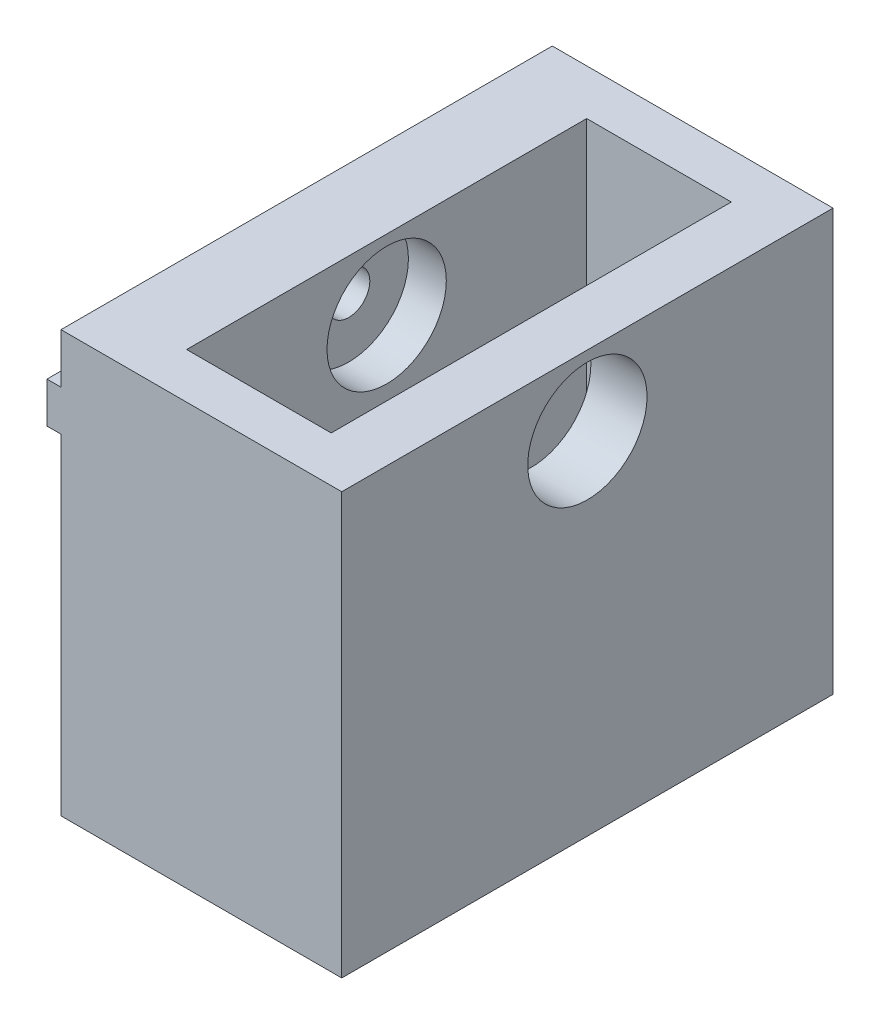
ISO-10303-21;
HEADER;
FILE_DESCRIPTION(('STEP AP214'),'2;1');
FILE_NAME('part.step','',(''),(''),'','','');
FILE_SCHEMA(('AUTOMOTIVE_DESIGN { 1 0 10303 214 1 1 1 1 }'));
ENDSEC;
DATA;
#1=APPLICATION_CONTEXT('core data for automotive mechanical design processes');
#2=APPLICATION_PROTOCOL_DEFINITION('international standard','automotive_design',2000,#1);
#3=PRODUCT_CONTEXT('',#1,'mechanical');
#4=PRODUCT('Part','Part','',(#3));
#5=PRODUCT_RELATED_PRODUCT_CATEGORY('part','',(#4));
#6=PRODUCT_DEFINITION_FORMATION('','',#4);
#7=PRODUCT_DEFINITION_CONTEXT('part definition',#1,'design');
#8=PRODUCT_DEFINITION('design','',#6,#7);
#9=PRODUCT_DEFINITION_SHAPE('','',#8);
#10=(LENGTH_UNIT() NAMED_UNIT(*) SI_UNIT(.MILLI.,.METRE.));
#11=(NAMED_UNIT(*) PLANE_ANGLE_UNIT() SI_UNIT($,.RADIAN.));
#12=(NAMED_UNIT(*) SI_UNIT($,.STERADIAN.) SOLID_ANGLE_UNIT());
#13=UNCERTAINTY_MEASURE_WITH_UNIT(LENGTH_MEASURE(1.E-05),#10,'distance_accuracy_value','');
#14=(GEOMETRIC_REPRESENTATION_CONTEXT(3) GLOBAL_UNCERTAINTY_ASSIGNED_CONTEXT((#13)) GLOBAL_UNIT_ASSIGNED_CONTEXT((#10,
#11,#12)) REPRESENTATION_CONTEXT('',''));
#15=CARTESIAN_POINT('',(0.,0.,0.));
#16=DIRECTION('',(0.,0.,1.));
#17=DIRECTION('',(1.,0.,0.));
#18=AXIS2_PLACEMENT_3D('',#15,#16,#17);
#19=CARTESIAN_POINT('',(20.,25.,0.));
#20=DIRECTION('',(-1.,0.,0.));
#21=DIRECTION('',(0.,-1.,0.));
#22=AXIS2_PLACEMENT_3D('',#19,#20,#21);
#23=CYLINDRICAL_SURFACE('',#22,1.5);
#24=CARTESIAN_POINT('',(0.,25.,0.));
#25=DIRECTION('',(1.,0.,0.));
#26=DIRECTION('',(0.,0.,-1.));
#27=AXIS2_PLACEMENT_3D('',#24,#25,#26);
#28=CIRCLE('',#27,1.5);
#29=CARTESIAN_POINT('',(0.,23.55,0.384057287393436));
#30=VERTEX_POINT('',#29);
#31=CARTESIAN_POINT('',(0.,23.55,-0.384057287393436));
#32=VERTEX_POINT('',#31);
#33=EDGE_CURVE('E151',#30,#32,#28,.T.);
#34=ORIENTED_EDGE('',*,*,#33,.F.);
#35=DIRECTION('',(-1.,0.,0.));
#36=VECTOR('',#35,1.);
#37=CARTESIAN_POINT('',(20.,23.5500000000001,0.384057287393672));
#38=LINE('',#37,#36);
#39=CARTESIAN_POINT('',(-0.999999999999998,23.55,0.384057287393423));
#40=VERTEX_POINT('',#39);
#41=EDGE_CURVE('E146',#40,#30,#38,.F.);
#42=ORIENTED_EDGE('',*,*,#41,.F.);
#43=CARTESIAN_POINT('',(-0.999999999999999,25.,0.));
#44=DIRECTION('',(-1.,0.,0.));
#45=DIRECTION('',(0.,-1.,0.));
#46=AXIS2_PLACEMENT_3D('',#43,#44,#45);
#47=CIRCLE('',#46,1.5);
#48=CARTESIAN_POINT('',(-0.999999999999999,26.45,0.384057287393449));
#49=VERTEX_POINT('',#48);
#50=EDGE_CURVE('E149',#40,#49,#47,.T.);
#51=ORIENTED_EDGE('',*,*,#50,.T.);
#52=DIRECTION('',(-1.,0.,0.));
#53=VECTOR('',#52,1.);
#54=CARTESIAN_POINT('',(20.,26.4500000000001,0.3840572873932));
#55=LINE('',#54,#53);
#56=CARTESIAN_POINT('',(0.,26.45,0.384057287393436));
#57=VERTEX_POINT('',#56);
#58=EDGE_CURVE('E50',#57,#49,#55,.T.);
#59=ORIENTED_EDGE('',*,*,#58,.F.);
#60=CARTESIAN_POINT('',(0.,25.,0.));
#61=DIRECTION('',(1.,0.,0.));
#62=DIRECTION('',(0.,0.,-1.));
#63=AXIS2_PLACEMENT_3D('',#60,#61,#62);
#64=CIRCLE('',#63,1.5);
#65=CARTESIAN_POINT('',(0.,26.45,-0.384057287393436));
#66=VERTEX_POINT('',#65);
#67=EDGE_CURVE('E164',#66,#57,#64,.T.);
#68=ORIENTED_EDGE('',*,*,#67,.F.);
#69=DIRECTION('',(-1.,0.,0.));
#70=VECTOR('',#69,1.);
#71=CARTESIAN_POINT('',(20.,26.4500000000001,-0.3840572873932));
#72=LINE('',#71,#70);
#73=CARTESIAN_POINT('',(-0.999999999999999,26.45,-0.384057287393449));
#74=VERTEX_POINT('',#73);
#75=EDGE_CURVE('E192',#74,#66,#72,.F.);
#76=ORIENTED_EDGE('',*,*,#75,.F.);
#77=CARTESIAN_POINT('',(-0.999999999999998,23.55,-0.384057287393423));
#78=VERTEX_POINT('',#77);
#79=EDGE_CURVE('E165',#74,#78,#47,.T.);
#80=ORIENTED_EDGE('',*,*,#79,.T.);
#81=DIRECTION('',(-1.,0.,0.));
#82=VECTOR('',#81,1.);
#83=CARTESIAN_POINT('',(20.,23.5500000000001,-0.384057287393672));
#84=LINE('',#83,#82);
#85=EDGE_CURVE('E156',#32,#78,#84,.T.);
#86=ORIENTED_EDGE('',*,*,#85,.F.);
#87=EDGE_LOOP('',(#34,#42,#51,#59,#68,#76,#80,#86));
#88=FACE_BOUND('',#87,.T.);
#89=CARTESIAN_POINT('',(3.,25.,0.));
#90=DIRECTION('',(1.,0.,0.));
#91=DIRECTION('',(0.,0.,-1.));
#92=AXIS2_PLACEMENT_3D('',#89,#90,#91);
#93=CIRCLE('',#92,1.5);
#94=CARTESIAN_POINT('',(3.,25.,-1.5));
#95=VERTEX_POINT('',#94);
#96=EDGE_CURVE('E174',#95,#95,#93,.F.);
#97=ORIENTED_EDGE('',*,*,#96,.F.);
#98=EDGE_LOOP('',(#97));
#99=FACE_BOUND('',#98,.T.);
#100=ADVANCED_FACE('F33',(#88,#99),#23,.F.);
#101=CARTESIAN_POINT('',(0.,26.45,17.5));
#102=DIRECTION('',(0.,-1.,0.));
#103=DIRECTION('',(1.,0.,0.));
#104=AXIS2_PLACEMENT_3D('',#101,#102,#103);
#105=PLANE('',#104);
#106=DIRECTION('',(0.,0.,-1.));
#107=VECTOR('',#106,1.);
#108=CARTESIAN_POINT('',(0.,26.45,17.5));
#109=LINE('',#108,#107);
#110=CARTESIAN_POINT('',(0.,26.45,17.5));
#111=VERTEX_POINT('',#110);
#112=EDGE_CURVE('E266',#111,#57,#109,.T.);
#113=ORIENTED_EDGE('',*,*,#112,.T.);
#114=ORIENTED_EDGE('',*,*,#58,.T.);
#115=DIRECTION('',(0.,0.,-1.));
#116=VECTOR('',#115,1.);
#117=CARTESIAN_POINT('',(-1.,26.45,17.5));
#118=LINE('',#117,#116);
#119=CARTESIAN_POINT('',(-1.,26.45,17.5));
#120=VERTEX_POINT('',#119);
#121=EDGE_CURVE('E11',#120,#49,#118,.T.);
#122=ORIENTED_EDGE('',*,*,#121,.F.);
#123=DIRECTION('',(-1.,0.,0.));
#124=VECTOR('',#123,1.);
#125=CARTESIAN_POINT('',(0.,26.45,17.5));
#126=LINE('',#125,#124);
#127=EDGE_CURVE('E230',#111,#120,#126,.T.);
#128=ORIENTED_EDGE('',*,*,#127,.F.);
#129=EDGE_LOOP('',(#113,#114,#122,#128));
#130=FACE_BOUND('',#129,.T.);
#131=ADVANCED_FACE('F295',(#130),#105,.F.);
#132=CARTESIAN_POINT('',(-1.,26.45,17.5));
#133=DIRECTION('',(1.,0.,0.));
#134=DIRECTION('',(0.,1.,0.));
#135=AXIS2_PLACEMENT_3D('',#132,#133,#134);
#136=PLANE('',#135);
#137=ORIENTED_EDGE('',*,*,#121,.T.);
#138=ORIENTED_EDGE('',*,*,#50,.F.);
#139=DIRECTION('',(0.,0.,-1.));
#140=VECTOR('',#139,1.);
#141=CARTESIAN_POINT('',(-0.999999999999999,23.55,17.5));
#142=LINE('',#141,#140);
#143=CARTESIAN_POINT('',(-0.999999999999999,23.55,17.5));
#144=VERTEX_POINT('',#143);
#145=EDGE_CURVE('E161',#144,#40,#142,.T.);
#146=ORIENTED_EDGE('',*,*,#145,.F.);
#147=DIRECTION('',(0.,-1.,0.));
#148=VECTOR('',#147,1.);
#149=CARTESIAN_POINT('',(-1.,26.45,17.5));
#150=LINE('',#149,#148);
#151=EDGE_CURVE('E233',#120,#144,#150,.T.);
#152=ORIENTED_EDGE('',*,*,#151,.F.);
#153=EDGE_LOOP('',(#137,#138,#146,#152));
#154=FACE_BOUND('',#153,.T.);
#155=ADVANCED_FACE('F160',(#154),#136,.F.);
#156=CARTESIAN_POINT('',(-0.999999999999999,23.55,17.5));
#157=DIRECTION('',(0.,1.,0.));
#158=DIRECTION('',(-1.,0.,0.));
#159=AXIS2_PLACEMENT_3D('',#156,#157,#158);
#160=PLANE('',#159);
#161=DIRECTION('',(0.,0.,-1.));
#162=VECTOR('',#161,1.);
#163=CARTESIAN_POINT('',(0.,23.55,17.5));
#164=LINE('',#163,#162);
#165=CARTESIAN_POINT('',(0.,23.55,-17.5));
#166=VERTEX_POINT('',#165);
#167=EDGE_CURVE('E279',#32,#166,#164,.T.);
#168=ORIENTED_EDGE('',*,*,#167,.F.);
#169=ORIENTED_EDGE('',*,*,#85,.T.);
#170=CARTESIAN_POINT('',(-0.999999999999999,23.55,-17.5));
#171=VERTEX_POINT('',#170);
#172=EDGE_CURVE('E169',#78,#171,#142,.T.);
#173=ORIENTED_EDGE('',*,*,#172,.T.);
#174=DIRECTION('',(1.,0.,0.));
#175=VECTOR('',#174,1.);
#176=CARTESIAN_POINT('',(-0.999999999999999,23.55,-17.5));
#177=LINE('',#176,#175);
#178=EDGE_CURVE('E253',#171,#166,#177,.T.);
#179=ORIENTED_EDGE('',*,*,#178,.T.);
#180=EDGE_LOOP('',(#168,#169,#173,#179));
#181=FACE_BOUND('',#180,.T.);
#182=ADVANCED_FACE('F313',(#181),#160,.F.);
#183=CARTESIAN_POINT('',(-1.,26.45,-17.5));
#184=VERTEX_POINT('',#183);
#185=EDGE_CURVE('E42',#74,#184,#118,.T.);
#186=ORIENTED_EDGE('',*,*,#185,.F.);
#187=ORIENTED_EDGE('',*,*,#75,.T.);
#188=CARTESIAN_POINT('',(0.,26.45,-17.5));
#189=VERTEX_POINT('',#188);
#190=EDGE_CURVE('E247',#66,#189,#109,.T.);
#191=ORIENTED_EDGE('',*,*,#190,.T.);
#192=DIRECTION('',(-1.,0.,0.));
#193=VECTOR('',#192,1.);
#194=CARTESIAN_POINT('',(0.,26.45,-17.5));
#195=LINE('',#194,#193);
#196=EDGE_CURVE('E223',#189,#184,#195,.T.);
#197=ORIENTED_EDGE('',*,*,#196,.T.);
#198=EDGE_LOOP('',(#186,#187,#191,#197));
#199=FACE_BOUND('',#198,.T.);
#200=ADVANCED_FACE('F35',(#199),#105,.F.);
#201=ORIENTED_EDGE('',*,*,#172,.F.);
#202=ORIENTED_EDGE('',*,*,#79,.F.);
#203=ORIENTED_EDGE('',*,*,#185,.T.);
#204=DIRECTION('',(0.,-1.,0.));
#205=VECTOR('',#204,1.);
#206=CARTESIAN_POINT('',(-1.,26.45,-17.5));
#207=LINE('',#206,#205);
#208=EDGE_CURVE('E250',#184,#171,#207,.T.);
#209=ORIENTED_EDGE('',*,*,#208,.T.);
#210=EDGE_LOOP('',(#201,#202,#203,#209));
#211=FACE_BOUND('',#210,.T.);
#212=ADVANCED_FACE('F306',(#211),#136,.F.);
#213=ORIENTED_EDGE('',*,*,#145,.T.);
#214=ORIENTED_EDGE('',*,*,#41,.T.);
#215=CARTESIAN_POINT('',(0.,23.55,17.5));
#216=VERTEX_POINT('',#215);
#217=EDGE_CURVE('E171',#216,#30,#164,.T.);
#218=ORIENTED_EDGE('',*,*,#217,.F.);
#219=DIRECTION('',(1.,0.,0.));
#220=VECTOR('',#219,1.);
#221=CARTESIAN_POINT('',(-0.999999999999999,23.55,17.5));
#222=LINE('',#221,#220);
#223=EDGE_CURVE('E168',#144,#216,#222,.T.);
#224=ORIENTED_EDGE('',*,*,#223,.F.);
#225=EDGE_LOOP('',(#213,#214,#218,#224));
#226=FACE_BOUND('',#225,.T.);
#227=ADVANCED_FACE('F167',(#226),#160,.F.);
#228=CARTESIAN_POINT('',(0.,23.55,17.5));
#229=DIRECTION('',(1.,0.,0.));
#230=DIRECTION('',(0.,0.,-1.));
#231=AXIS2_PLACEMENT_3D('',#228,#229,#230);
#232=PLANE('',#231);
#233=ORIENTED_EDGE('',*,*,#217,.T.);
#234=ORIENTED_EDGE('',*,*,#33,.T.);
#235=ORIENTED_EDGE('',*,*,#167,.T.);
#236=DIRECTION('',(0.,-1.,0.));
#237=VECTOR('',#236,1.);
#238=CARTESIAN_POINT('',(0.,23.55,-17.5));
#239=LINE('',#238,#237);
#240=CARTESIAN_POINT('',(0.,0.,-17.5));
#241=VERTEX_POINT('',#240);
#242=EDGE_CURVE('E256',#166,#241,#239,.T.);
#243=ORIENTED_EDGE('',*,*,#242,.T.);
#244=DIRECTION('',(0.,0.,-1.));
#245=VECTOR('',#244,1.);
#246=CARTESIAN_POINT('',(0.,0.,17.5));
#247=LINE('',#246,#245);
#248=CARTESIAN_POINT('',(0.,0.,17.5));
#249=VERTEX_POINT('',#248);
#250=EDGE_CURVE('E277',#249,#241,#247,.T.);
#251=ORIENTED_EDGE('',*,*,#250,.F.);
#252=DIRECTION('',(0.,-1.,0.));
#253=VECTOR('',#252,1.);
#254=CARTESIAN_POINT('',(0.,23.55,17.5));
#255=LINE('',#254,#253);
#256=EDGE_CURVE('E237',#216,#249,#255,.T.);
#257=ORIENTED_EDGE('',*,*,#256,.F.);
#258=EDGE_LOOP('',(#233,#234,#235,#243,#251,#257));
#259=FACE_BOUND('',#258,.T.);
#260=ADVANCED_FACE('F287',(#259),#232,.F.);
#261=CARTESIAN_POINT('',(0.,0.,17.5));
#262=DIRECTION('',(0.,1.,0.));
#263=DIRECTION('',(0.,0.,1.));
#264=AXIS2_PLACEMENT_3D('',#261,#262,#263);
#265=PLANE('',#264);
#266=DIRECTION('',(-1.,0.,0.));
#267=VECTOR('',#266,1.);
#268=CARTESIAN_POINT('',(5.69999999999999,0.,-14.25));
#269=LINE('',#268,#267);
#270=CARTESIAN_POINT('',(16.,0.,-14.25));
#271=VERTEX_POINT('',#270);
#272=CARTESIAN_POINT('',(5.69999999999999,0.,-14.25));
#273=VERTEX_POINT('',#272);
#274=EDGE_CURVE('E208',#271,#273,#269,.T.);
#275=ORIENTED_EDGE('',*,*,#274,.T.);
#276=DIRECTION('',(0.,0.,1.));
#277=VECTOR('',#276,1.);
#278=CARTESIAN_POINT('',(5.69999999999999,0.,-14.25));
#279=LINE('',#278,#277);
#280=CARTESIAN_POINT('',(5.69999999999999,0.,14.25));
#281=VERTEX_POINT('',#280);
#282=EDGE_CURVE('E200',#273,#281,#279,.T.);
#283=ORIENTED_EDGE('',*,*,#282,.T.);
#284=DIRECTION('',(1.,0.,0.));
#285=VECTOR('',#284,1.);
#286=CARTESIAN_POINT('',(5.69999999999999,0.,14.25));
#287=LINE('',#286,#285);
#288=CARTESIAN_POINT('',(16.,0.,14.25));
#289=VERTEX_POINT('',#288);
#290=EDGE_CURVE('E203',#281,#289,#287,.T.);
#291=ORIENTED_EDGE('',*,*,#290,.T.);
#292=DIRECTION('',(0.,0.,-1.));
#293=VECTOR('',#292,1.);
#294=CARTESIAN_POINT('',(16.,0.,-14.25));
#295=LINE('',#294,#293);
#296=EDGE_CURVE('E58',#289,#271,#295,.T.);
#297=ORIENTED_EDGE('',*,*,#296,.T.);
#298=EDGE_LOOP('',(#275,#283,#291,#297));
#299=FACE_BOUND('',#298,.T.);
#300=DIRECTION('',(1.,0.,0.));
#301=VECTOR('',#300,1.);
#302=CARTESIAN_POINT('',(0.,0.,-17.5));
#303=LINE('',#302,#301);
#304=CARTESIAN_POINT('',(20.,0.,-17.5));
#305=VERTEX_POINT('',#304);
#306=EDGE_CURVE('E258',#241,#305,#303,.T.);
#307=ORIENTED_EDGE('',*,*,#306,.T.);
#308=DIRECTION('',(0.,0.,-1.));
#309=VECTOR('',#308,1.);
#310=CARTESIAN_POINT('',(20.,0.,17.5));
#311=LINE('',#310,#309);
#312=CARTESIAN_POINT('',(20.,0.,17.5));
#313=VERTEX_POINT('',#312);
#314=EDGE_CURVE('E275',#313,#305,#311,.T.);
#315=ORIENTED_EDGE('',*,*,#314,.F.);
#316=DIRECTION('',(1.,0.,0.));
#317=VECTOR('',#316,1.);
#318=CARTESIAN_POINT('',(0.,0.,17.5));
#319=LINE('',#318,#317);
#320=EDGE_CURVE('E239',#249,#313,#319,.T.);
#321=ORIENTED_EDGE('',*,*,#320,.F.);
#322=ORIENTED_EDGE('',*,*,#250,.T.);
#323=EDGE_LOOP('',(#307,#315,#321,#322));
#324=FACE_BOUND('',#323,.T.);
#325=ADVANCED_FACE('F361',(#299,#324),#265,.F.);
#326=CARTESIAN_POINT('',(20.,0.,17.5));
#327=DIRECTION('',(-1.,0.,0.));
#328=DIRECTION('',(0.,-1.,0.));
#329=AXIS2_PLACEMENT_3D('',#326,#327,#328);
#330=PLANE('',#329);
#331=CARTESIAN_POINT('',(20.,25.,0.));
#332=DIRECTION('',(1.,0.,0.));
#333=DIRECTION('',(0.,0.,-1.));
#334=AXIS2_PLACEMENT_3D('',#331,#332,#333);
#335=CIRCLE('',#334,4.25);
#336=CARTESIAN_POINT('',(20.,25.,-4.25));
#337=VERTEX_POINT('',#336);
#338=EDGE_CURVE('E182',#337,#337,#335,.T.);
#339=ORIENTED_EDGE('',*,*,#338,.F.);
#340=EDGE_LOOP('',(#339));
#341=FACE_BOUND('',#340,.T.);
#342=DIRECTION('',(0.,1.,0.));
#343=VECTOR('',#342,1.);
#344=CARTESIAN_POINT('',(20.,0.,-17.5));
#345=LINE('',#344,#343);
#346=CARTESIAN_POINT('',(20.,30.,-17.5));
#347=VERTEX_POINT('',#346);
#348=EDGE_CURVE('E260',#305,#347,#345,.T.);
#349=ORIENTED_EDGE('',*,*,#348,.T.);
#350=DIRECTION('',(0.,0.,-1.));
#351=VECTOR('',#350,1.);
#352=CARTESIAN_POINT('',(20.,30.,17.5));
#353=LINE('',#352,#351);
#354=CARTESIAN_POINT('',(20.,30.,17.5));
#355=VERTEX_POINT('',#354);
#356=EDGE_CURVE('E272',#355,#347,#353,.T.);
#357=ORIENTED_EDGE('',*,*,#356,.F.);
#358=DIRECTION('',(0.,1.,0.));
#359=VECTOR('',#358,1.);
#360=CARTESIAN_POINT('',(20.,0.,17.5));
#361=LINE('',#360,#359);
#362=EDGE_CURVE('E241',#313,#355,#361,.T.);
#363=ORIENTED_EDGE('',*,*,#362,.F.);
#364=ORIENTED_EDGE('',*,*,#314,.T.);
#365=EDGE_LOOP('',(#349,#357,#363,#364));
#366=FACE_BOUND('',#365,.T.);
#367=ADVANCED_FACE('F357',(#341,#366),#330,.F.);
#368=CARTESIAN_POINT('',(20.,30.,17.5));
#369=DIRECTION('',(0.,-1.,0.));
#370=DIRECTION('',(0.,0.,-1.));
#371=AXIS2_PLACEMENT_3D('',#368,#369,#370);
#372=PLANE('',#371);
#373=DIRECTION('',(1.,0.,0.));
#374=VECTOR('',#373,1.);
#375=CARTESIAN_POINT('',(5.69999999999999,30.,14.25));
#376=LINE('',#375,#374);
#377=CARTESIAN_POINT('',(5.69999999999999,30.,14.25));
#378=VERTEX_POINT('',#377);
#379=CARTESIAN_POINT('',(16.,30.,14.25));
#380=VERTEX_POINT('',#379);
#381=EDGE_CURVE('E213',#378,#380,#376,.T.);
#382=ORIENTED_EDGE('',*,*,#381,.F.);
#383=DIRECTION('',(0.,0.,1.));
#384=VECTOR('',#383,1.);
#385=CARTESIAN_POINT('',(5.69999999999999,30.,-14.25));
#386=LINE('',#385,#384);
#387=CARTESIAN_POINT('',(5.69999999999999,30.,-14.25));
#388=VERTEX_POINT('',#387);
#389=EDGE_CURVE('E199',#388,#378,#386,.T.);
#390=ORIENTED_EDGE('',*,*,#389,.F.);
#391=DIRECTION('',(-1.,0.,0.));
#392=VECTOR('',#391,1.);
#393=CARTESIAN_POINT('',(5.69999999999999,30.,-14.25));
#394=LINE('',#393,#392);
#395=CARTESIAN_POINT('',(16.,30.,-14.25));
#396=VERTEX_POINT('',#395);
#397=EDGE_CURVE('E204',#396,#388,#394,.T.);
#398=ORIENTED_EDGE('',*,*,#397,.F.);
#399=DIRECTION('',(0.,0.,-1.));
#400=VECTOR('',#399,1.);
#401=CARTESIAN_POINT('',(16.,30.,-14.25));
#402=LINE('',#401,#400);
#403=EDGE_CURVE('E216',#380,#396,#402,.T.);
#404=ORIENTED_EDGE('',*,*,#403,.F.);
#405=EDGE_LOOP('',(#382,#390,#398,#404));
#406=FACE_BOUND('',#405,.T.);
#407=DIRECTION('',(-1.,0.,0.));
#408=VECTOR('',#407,1.);
#409=CARTESIAN_POINT('',(20.,30.,-17.5));
#410=LINE('',#409,#408);
#411=CARTESIAN_POINT('',(0.,30.,-17.5));
#412=VERTEX_POINT('',#411);
#413=EDGE_CURVE('E262',#347,#412,#410,.T.);
#414=ORIENTED_EDGE('',*,*,#413,.T.);
#415=DIRECTION('',(0.,0.,-1.));
#416=VECTOR('',#415,1.);
#417=CARTESIAN_POINT('',(0.,30.,17.5));
#418=LINE('',#417,#416);
#419=CARTESIAN_POINT('',(0.,30.,17.5));
#420=VERTEX_POINT('',#419);
#421=EDGE_CURVE('E269',#420,#412,#418,.T.);
#422=ORIENTED_EDGE('',*,*,#421,.F.);
#423=DIRECTION('',(-1.,0.,0.));
#424=VECTOR('',#423,1.);
#425=CARTESIAN_POINT('',(20.,30.,17.5));
#426=LINE('',#425,#424);
#427=EDGE_CURVE('E243',#355,#420,#426,.T.);
#428=ORIENTED_EDGE('',*,*,#427,.F.);
#429=ORIENTED_EDGE('',*,*,#356,.T.);
#430=EDGE_LOOP('',(#414,#422,#428,#429));
#431=FACE_BOUND('',#430,.T.);
#432=ADVANCED_FACE('F354',(#406,#431),#372,.F.);
#433=CARTESIAN_POINT('',(0.,30.,17.5));
#434=DIRECTION('',(1.,0.,0.));
#435=DIRECTION('',(0.,0.,-1.));
#436=AXIS2_PLACEMENT_3D('',#433,#434,#435);
#437=PLANE('',#436);
#438=ORIENTED_EDGE('',*,*,#190,.F.);
#439=ORIENTED_EDGE('',*,*,#67,.T.);
#440=ORIENTED_EDGE('',*,*,#112,.F.);
#441=DIRECTION('',(0.,-1.,0.));
#442=VECTOR('',#441,1.);
#443=CARTESIAN_POINT('',(0.,30.,17.5));
#444=LINE('',#443,#442);
#445=EDGE_CURVE('E245',#420,#111,#444,.T.);
#446=ORIENTED_EDGE('',*,*,#445,.F.);
#447=ORIENTED_EDGE('',*,*,#421,.T.);
#448=DIRECTION('',(0.,-1.,0.));
#449=VECTOR('',#448,1.);
#450=CARTESIAN_POINT('',(0.,30.,-17.5));
#451=LINE('',#450,#449);
#452=EDGE_CURVE('E234',#412,#189,#451,.T.);
#453=ORIENTED_EDGE('',*,*,#452,.T.);
#454=EDGE_LOOP('',(#438,#439,#440,#446,#447,#453));
#455=FACE_BOUND('',#454,.T.);
#456=ADVANCED_FACE('F298',(#455),#437,.F.);
#457=CARTESIAN_POINT('',(0.,0.,17.5));
#458=DIRECTION('',(0.,0.,1.));
#459=DIRECTION('',(1.,0.,0.));
#460=AXIS2_PLACEMENT_3D('',#457,#458,#459);
#461=PLANE('',#460);
#462=ORIENTED_EDGE('',*,*,#127,.T.);
#463=ORIENTED_EDGE('',*,*,#151,.T.);
#464=ORIENTED_EDGE('',*,*,#223,.T.);
#465=ORIENTED_EDGE('',*,*,#256,.T.);
#466=ORIENTED_EDGE('',*,*,#320,.T.);
#467=ORIENTED_EDGE('',*,*,#362,.T.);
#468=ORIENTED_EDGE('',*,*,#427,.T.);
#469=ORIENTED_EDGE('',*,*,#445,.T.);
#470=EDGE_LOOP('',(#462,#463,#464,#465,#466,#467,#468,#469));
#471=FACE_BOUND('',#470,.T.);
#472=ADVANCED_FACE('F289',(#471),#461,.T.);
#473=CARTESIAN_POINT('',(0.,0.,-17.5));
#474=DIRECTION('',(0.,0.,1.));
#475=DIRECTION('',(1.,0.,0.));
#476=AXIS2_PLACEMENT_3D('',#473,#474,#475);
#477=PLANE('',#476);
#478=ORIENTED_EDGE('',*,*,#196,.F.);
#479=ORIENTED_EDGE('',*,*,#452,.F.);
#480=ORIENTED_EDGE('',*,*,#413,.F.);
#481=ORIENTED_EDGE('',*,*,#348,.F.);
#482=ORIENTED_EDGE('',*,*,#306,.F.);
#483=ORIENTED_EDGE('',*,*,#242,.F.);
#484=ORIENTED_EDGE('',*,*,#178,.F.);
#485=ORIENTED_EDGE('',*,*,#208,.F.);
#486=EDGE_LOOP('',(#478,#479,#480,#481,#482,#483,#484,#485));
#487=FACE_BOUND('',#486,.T.);
#488=ADVANCED_FACE('F309',(#487),#477,.F.);
#489=CARTESIAN_POINT('',(5.69999999999999,0.,-14.25));
#490=DIRECTION('',(-1.,0.,0.));
#491=DIRECTION('',(0.,0.,1.));
#492=AXIS2_PLACEMENT_3D('',#489,#490,#491);
#493=PLANE('',#492);
#494=CARTESIAN_POINT('',(5.69999999999999,25.,0.));
#495=DIRECTION('',(-1.,0.,0.));
#496=DIRECTION('',(0.,0.,1.));
#497=AXIS2_PLACEMENT_3D('',#494,#495,#496);
#498=CIRCLE('',#497,4.25);
#499=CARTESIAN_POINT('',(5.69999999999999,25.,4.25));
#500=VERTEX_POINT('',#499);
#501=EDGE_CURVE('E180',#500,#500,#498,.T.);
#502=ORIENTED_EDGE('',*,*,#501,.T.);
#503=EDGE_LOOP('',(#502));
#504=FACE_BOUND('',#503,.T.);
#505=ORIENTED_EDGE('',*,*,#389,.T.);
#506=DIRECTION('',(0.,1.,0.));
#507=VECTOR('',#506,1.);
#508=CARTESIAN_POINT('',(5.69999999999999,0.,14.25));
#509=LINE('',#508,#507);
#510=EDGE_CURVE('E211',#281,#378,#509,.T.);
#511=ORIENTED_EDGE('',*,*,#510,.F.);
#512=ORIENTED_EDGE('',*,*,#282,.F.);
#513=DIRECTION('',(0.,1.,0.));
#514=VECTOR('',#513,1.);
#515=CARTESIAN_POINT('',(5.69999999999999,0.,-14.25));
#516=LINE('',#515,#514);
#517=EDGE_CURVE('E221',#273,#388,#516,.T.);
#518=ORIENTED_EDGE('',*,*,#517,.T.);
#519=EDGE_LOOP('',(#505,#511,#512,#518));
#520=FACE_BOUND('',#519,.T.);
#521=ADVANCED_FACE('F335',(#504,#520),#493,.F.);
#522=CARTESIAN_POINT('',(5.69999999999999,0.,-14.25));
#523=DIRECTION('',(0.,0.,-1.));
#524=DIRECTION('',(-1.,0.,0.));
#525=AXIS2_PLACEMENT_3D('',#522,#523,#524);
#526=PLANE('',#525);
#527=ORIENTED_EDGE('',*,*,#397,.T.);
#528=ORIENTED_EDGE('',*,*,#517,.F.);
#529=ORIENTED_EDGE('',*,*,#274,.F.);
#530=DIRECTION('',(0.,1.,0.));
#531=VECTOR('',#530,1.);
#532=CARTESIAN_POINT('',(16.,0.,-14.25));
#533=LINE('',#532,#531);
#534=EDGE_CURVE('E224',#271,#396,#533,.T.);
#535=ORIENTED_EDGE('',*,*,#534,.T.);
#536=EDGE_LOOP('',(#527,#528,#529,#535));
#537=FACE_BOUND('',#536,.T.);
#538=ADVANCED_FACE('F331',(#537),#526,.F.);
#539=CARTESIAN_POINT('',(16.,0.,-14.25));
#540=DIRECTION('',(1.,0.,0.));
#541=DIRECTION('',(0.,0.,-1.));
#542=AXIS2_PLACEMENT_3D('',#539,#540,#541);
#543=PLANE('',#542);
#544=CARTESIAN_POINT('',(16.,25.,0.));
#545=DIRECTION('',(1.,0.,0.));
#546=DIRECTION('',(0.,0.,-1.));
#547=AXIS2_PLACEMENT_3D('',#544,#545,#546);
#548=CIRCLE('',#547,4.25);
#549=CARTESIAN_POINT('',(16.,25.,-4.25));
#550=VERTEX_POINT('',#549);
#551=EDGE_CURVE('E37',#550,#550,#548,.T.);
#552=ORIENTED_EDGE('',*,*,#551,.T.);
#553=EDGE_LOOP('',(#552));
#554=FACE_BOUND('',#553,.T.);
#555=ORIENTED_EDGE('',*,*,#403,.T.);
#556=ORIENTED_EDGE('',*,*,#534,.F.);
#557=ORIENTED_EDGE('',*,*,#296,.F.);
#558=DIRECTION('',(0.,1.,0.));
#559=VECTOR('',#558,1.);
#560=CARTESIAN_POINT('',(16.,0.,14.25));
#561=LINE('',#560,#559);
#562=EDGE_CURVE('E226',#289,#380,#561,.T.);
#563=ORIENTED_EDGE('',*,*,#562,.T.);
#564=EDGE_LOOP('',(#555,#556,#557,#563));
#565=FACE_BOUND('',#564,.T.);
#566=ADVANCED_FACE('F334',(#554,#565),#543,.F.);
#567=CARTESIAN_POINT('',(5.69999999999999,0.,14.25));
#568=DIRECTION('',(0.,0.,1.));
#569=DIRECTION('',(1.,0.,0.));
#570=AXIS2_PLACEMENT_3D('',#567,#568,#569);
#571=PLANE('',#570);
#572=ORIENTED_EDGE('',*,*,#381,.T.);
#573=ORIENTED_EDGE('',*,*,#562,.F.);
#574=ORIENTED_EDGE('',*,*,#290,.F.);
#575=ORIENTED_EDGE('',*,*,#510,.T.);
#576=EDGE_LOOP('',(#572,#573,#574,#575));
#577=FACE_BOUND('',#576,.T.);
#578=ADVANCED_FACE('F339',(#577),#571,.F.);
#579=CARTESIAN_POINT('',(3.,0.,0.));
#580=DIRECTION('',(1.,0.,0.));
#581=DIRECTION('',(0.,0.,-1.));
#582=AXIS2_PLACEMENT_3D('',#579,#580,#581);
#583=PLANE('',#582);
#584=CARTESIAN_POINT('',(3.,25.,0.));
#585=DIRECTION('',(1.,0.,0.));
#586=DIRECTION('',(0.,0.,-1.));
#587=AXIS2_PLACEMENT_3D('',#584,#585,#586);
#588=CIRCLE('',#587,4.25);
#589=CARTESIAN_POINT('',(3.,25.,-4.25));
#590=VERTEX_POINT('',#589);
#591=EDGE_CURVE('E176',#590,#590,#588,.F.);
#592=ORIENTED_EDGE('',*,*,#591,.F.);
#593=EDGE_LOOP('',(#592));
#594=FACE_BOUND('',#593,.T.);
#595=ORIENTED_EDGE('',*,*,#96,.T.);
#596=EDGE_LOOP('',(#595));
#597=FACE_BOUND('',#596,.T.);
#598=ADVANCED_FACE('F343',(#594,#597),#583,.T.);
#599=CARTESIAN_POINT('',(-9.02081528017131,25.,0.));
#600=DIRECTION('',(1.,0.,0.));
#601=DIRECTION('',(0.,0.,-1.));
#602=AXIS2_PLACEMENT_3D('',#599,#600,#601);
#603=CYLINDRICAL_SURFACE('',#602,4.25);
#604=ORIENTED_EDGE('',*,*,#591,.T.);
#605=EDGE_LOOP('',(#604));
#606=FACE_BOUND('',#605,.T.);
#607=ORIENTED_EDGE('',*,*,#501,.F.);
#608=EDGE_LOOP('',(#607));
#609=FACE_BOUND('',#608,.T.);
#610=ADVANCED_FACE('F329',(#606,#609),#603,.F.);
#611=ORIENTED_EDGE('',*,*,#338,.T.);
#612=EDGE_LOOP('',(#611));
#613=FACE_BOUND('',#612,.T.);
#614=ORIENTED_EDGE('',*,*,#551,.F.);
#615=EDGE_LOOP('',(#614));
#616=FACE_BOUND('',#615,.T.);
#617=ADVANCED_FACE('F424',(#613,#616),#603,.F.);
#618=CLOSED_SHELL('',(#100,#131,#155,#182,#200,#212,#227,#260,#325,#367,#432,#456,#472,#488,
#521,#538,#566,#578,#598,#610,#617));
#619=MANIFOLD_SOLID_BREP('B2',#618);
#620=ADVANCED_BREP_SHAPE_REPRESENTATION('',(#18,#619),#14);
#621=SHAPE_DEFINITION_REPRESENTATION(#9,#620);
ENDSEC;
END-ISO-10303-21;
